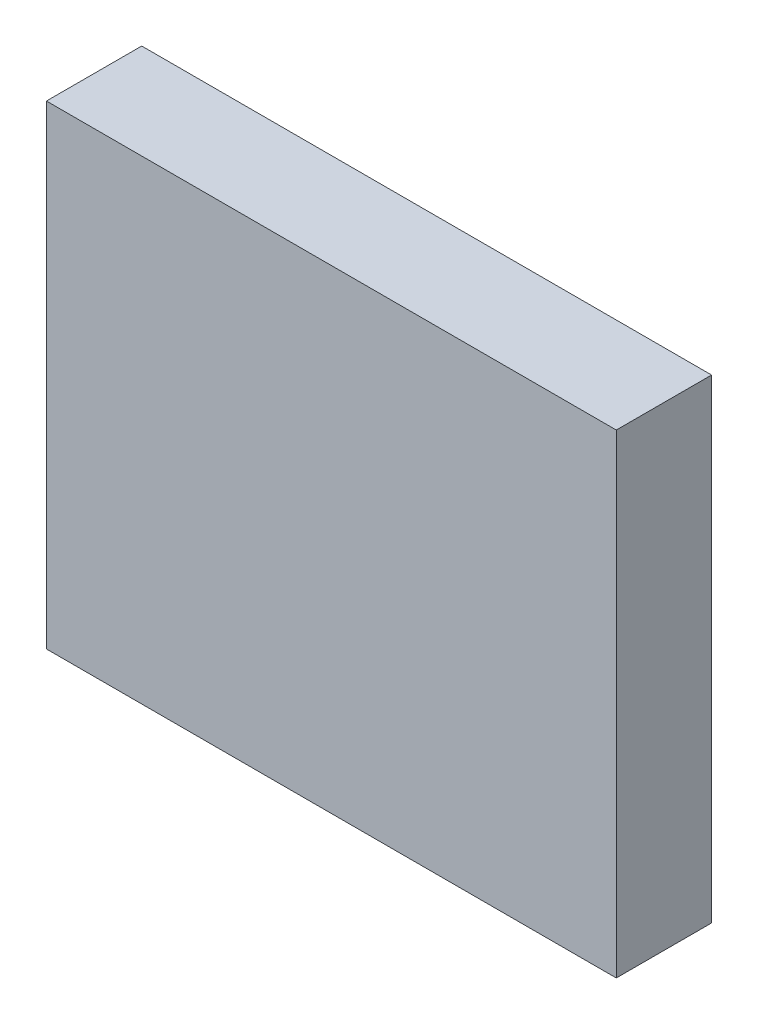
ISO-10303-21;
HEADER;
FILE_DESCRIPTION(('STEP AP214'),'2;1');
FILE_NAME('part.step','',(''),(''),'','','');
FILE_SCHEMA(('AUTOMOTIVE_DESIGN { 1 0 10303 214 1 1 1 1 }'));
ENDSEC;
DATA;
#1=APPLICATION_CONTEXT('core data for automotive mechanical design processes');
#2=APPLICATION_PROTOCOL_DEFINITION('international standard','automotive_design',2000,#1);
#3=PRODUCT_CONTEXT('',#1,'mechanical');
#4=PRODUCT('Part','Part','',(#3));
#5=PRODUCT_RELATED_PRODUCT_CATEGORY('part','',(#4));
#6=PRODUCT_DEFINITION_FORMATION('','',#4);
#7=PRODUCT_DEFINITION_CONTEXT('part definition',#1,'design');
#8=PRODUCT_DEFINITION('design','',#6,#7);
#9=PRODUCT_DEFINITION_SHAPE('','',#8);
#10=(LENGTH_UNIT() NAMED_UNIT(*) SI_UNIT(.MILLI.,.METRE.));
#11=(NAMED_UNIT(*) PLANE_ANGLE_UNIT() SI_UNIT($,.RADIAN.));
#12=(NAMED_UNIT(*) SI_UNIT($,.STERADIAN.) SOLID_ANGLE_UNIT());
#13=UNCERTAINTY_MEASURE_WITH_UNIT(LENGTH_MEASURE(1.E-05),#10,'distance_accuracy_value','');
#14=(GEOMETRIC_REPRESENTATION_CONTEXT(3) GLOBAL_UNCERTAINTY_ASSIGNED_CONTEXT((#13)) GLOBAL_UNIT_ASSIGNED_CONTEXT((#10,
#11,#12)) REPRESENTATION_CONTEXT('',''));
#15=CARTESIAN_POINT('',(0.,0.,0.));
#16=DIRECTION('',(0.,0.,1.));
#17=DIRECTION('',(1.,0.,0.));
#18=AXIS2_PLACEMENT_3D('',#15,#16,#17);
#19=CARTESIAN_POINT('',(0.698,0.373,0.));
#20=DIRECTION('',(0.,-1.,0.));
#21=DIRECTION('',(0.,0.,1.));
#22=AXIS2_PLACEMENT_3D('',#19,#20,#21);
#23=PLANE('',#22);
#24=DIRECTION('',(-1.,0.,0.));
#25=VECTOR('',#24,1.);
#26=CARTESIAN_POINT('',(1.003,0.373,0.));
#27=LINE('',#26,#25);
#28=CARTESIAN_POINT('',(1.003,0.373,0.));
#29=VERTEX_POINT('',#28);
#30=CARTESIAN_POINT('',(0.698,0.373,0.));
#31=VERTEX_POINT('',#30);
#32=EDGE_CURVE('E11',#29,#31,#27,.T.);
#33=ORIENTED_EDGE('',*,*,#32,.F.);
#34=DIRECTION('',(0.,0.,-1.));
#35=VECTOR('',#34,1.);
#36=CARTESIAN_POINT('',(1.003,0.373,0.051));
#37=LINE('',#36,#35);
#38=CARTESIAN_POINT('',(1.003,0.373,0.051));
#39=VERTEX_POINT('',#38);
#40=EDGE_CURVE('E24',#39,#29,#37,.T.);
#41=ORIENTED_EDGE('',*,*,#40,.F.);
#42=DIRECTION('',(1.,0.,0.));
#43=VECTOR('',#42,1.);
#44=CARTESIAN_POINT('',(0.698,0.373,0.051));
#45=LINE('',#44,#43);
#46=CARTESIAN_POINT('',(0.698,0.373,0.051));
#47=VERTEX_POINT('',#46);
#48=EDGE_CURVE('E88',#47,#39,#45,.T.);
#49=ORIENTED_EDGE('',*,*,#48,.F.);
#50=DIRECTION('',(0.,0.,1.));
#51=VECTOR('',#50,1.);
#52=CARTESIAN_POINT('',(0.698,0.373,0.));
#53=LINE('',#52,#51);
#54=EDGE_CURVE('E77',#31,#47,#53,.T.);
#55=ORIENTED_EDGE('',*,*,#54,.F.);
#56=EDGE_LOOP('',(#33,#41,#49,#55));
#57=FACE_BOUND('',#56,.T.);
#58=ADVANCED_FACE('F17',(#57),#23,.T.);
#59=CARTESIAN_POINT('',(1.003,0.373,0.));
#60=DIRECTION('',(1.,0.,0.));
#61=DIRECTION('',(0.,0.,1.));
#62=AXIS2_PLACEMENT_3D('',#59,#60,#61);
#63=PLANE('',#62);
#64=DIRECTION('',(0.,-1.,0.));
#65=VECTOR('',#64,1.);
#66=CARTESIAN_POINT('',(1.003,0.627,0.));
#67=LINE('',#66,#65);
#68=CARTESIAN_POINT('',(1.003,0.627,0.));
#69=VERTEX_POINT('',#68);
#70=EDGE_CURVE('E85',#69,#29,#67,.T.);
#71=ORIENTED_EDGE('',*,*,#70,.F.);
#72=DIRECTION('',(0.,0.,-1.));
#73=VECTOR('',#72,1.);
#74=CARTESIAN_POINT('',(1.003,0.627,0.051));
#75=LINE('',#74,#73);
#76=CARTESIAN_POINT('',(1.003,0.627,0.051));
#77=VERTEX_POINT('',#76);
#78=EDGE_CURVE('E83',#77,#69,#75,.T.);
#79=ORIENTED_EDGE('',*,*,#78,.F.);
#80=DIRECTION('',(0.,1.,0.));
#81=VECTOR('',#80,1.);
#82=CARTESIAN_POINT('',(1.003,0.373,0.051));
#83=LINE('',#82,#81);
#84=EDGE_CURVE('E72',#39,#77,#83,.T.);
#85=ORIENTED_EDGE('',*,*,#84,.F.);
#86=ORIENTED_EDGE('',*,*,#40,.T.);
#87=EDGE_LOOP('',(#71,#79,#85,#86));
#88=FACE_BOUND('',#87,.T.);
#89=ADVANCED_FACE('F90',(#88),#63,.T.);
#90=CARTESIAN_POINT('',(1.003,0.627,0.));
#91=DIRECTION('',(0.,1.,0.));
#92=DIRECTION('',(0.,0.,1.));
#93=AXIS2_PLACEMENT_3D('',#90,#91,#92);
#94=PLANE('',#93);
#95=DIRECTION('',(1.,0.,0.));
#96=VECTOR('',#95,1.);
#97=CARTESIAN_POINT('',(0.698,0.627,0.));
#98=LINE('',#97,#96);
#99=CARTESIAN_POINT('',(0.698,0.627,0.));
#100=VERTEX_POINT('',#99);
#101=EDGE_CURVE('E60',#100,#69,#98,.T.);
#102=ORIENTED_EDGE('',*,*,#101,.F.);
#103=DIRECTION('',(0.,0.,-1.));
#104=VECTOR('',#103,1.);
#105=CARTESIAN_POINT('',(0.698,0.627,0.051));
#106=LINE('',#105,#104);
#107=CARTESIAN_POINT('',(0.698,0.627,0.051));
#108=VERTEX_POINT('',#107);
#109=EDGE_CURVE('E54',#108,#100,#106,.T.);
#110=ORIENTED_EDGE('',*,*,#109,.F.);
#111=DIRECTION('',(-1.,0.,0.));
#112=VECTOR('',#111,1.);
#113=CARTESIAN_POINT('',(1.003,0.627,0.051));
#114=LINE('',#113,#112);
#115=EDGE_CURVE('E58',#77,#108,#114,.T.);
#116=ORIENTED_EDGE('',*,*,#115,.F.);
#117=ORIENTED_EDGE('',*,*,#78,.T.);
#118=EDGE_LOOP('',(#102,#110,#116,#117));
#119=FACE_BOUND('',#118,.T.);
#120=ADVANCED_FACE('F56',(#119),#94,.T.);
#121=CARTESIAN_POINT('',(0.698,0.627,0.));
#122=DIRECTION('',(-1.,0.,0.));
#123=DIRECTION('',(0.,0.,1.));
#124=AXIS2_PLACEMENT_3D('',#121,#122,#123);
#125=PLANE('',#124);
#126=DIRECTION('',(0.,1.,0.));
#127=VECTOR('',#126,1.);
#128=CARTESIAN_POINT('',(0.698,0.373,0.));
#129=LINE('',#128,#127);
#130=EDGE_CURVE('E73',#31,#100,#129,.T.);
#131=ORIENTED_EDGE('',*,*,#130,.F.);
#132=ORIENTED_EDGE('',*,*,#54,.T.);
#133=DIRECTION('',(0.,-1.,0.));
#134=VECTOR('',#133,1.);
#135=CARTESIAN_POINT('',(0.698,0.627,0.051));
#136=LINE('',#135,#134);
#137=EDGE_CURVE('E70',#108,#47,#136,.T.);
#138=ORIENTED_EDGE('',*,*,#137,.F.);
#139=ORIENTED_EDGE('',*,*,#109,.T.);
#140=EDGE_LOOP('',(#131,#132,#138,#139));
#141=FACE_BOUND('',#140,.T.);
#142=ADVANCED_FACE('F76',(#141),#125,.T.);
#143=CARTESIAN_POINT('',(0.698,0.627,0.));
#144=DIRECTION('',(0.,0.,-1.));
#145=DIRECTION('',(0.,1.,0.));
#146=AXIS2_PLACEMENT_3D('',#143,#144,#145);
#147=PLANE('',#146);
#148=ORIENTED_EDGE('',*,*,#101,.T.);
#149=ORIENTED_EDGE('',*,*,#70,.T.);
#150=ORIENTED_EDGE('',*,*,#32,.T.);
#151=ORIENTED_EDGE('',*,*,#130,.T.);
#152=EDGE_LOOP('',(#148,#149,#150,#151));
#153=FACE_BOUND('',#152,.T.);
#154=ADVANCED_FACE('F91',(#153),#147,.T.);
#155=CARTESIAN_POINT('',(0.698,0.373,0.051));
#156=DIRECTION('',(0.,0.,1.));
#157=DIRECTION('',(0.,1.,0.));
#158=AXIS2_PLACEMENT_3D('',#155,#156,#157);
#159=PLANE('',#158);
#160=ORIENTED_EDGE('',*,*,#48,.T.);
#161=ORIENTED_EDGE('',*,*,#84,.T.);
#162=ORIENTED_EDGE('',*,*,#115,.T.);
#163=ORIENTED_EDGE('',*,*,#137,.T.);
#164=EDGE_LOOP('',(#160,#161,#162,#163));
#165=FACE_BOUND('',#164,.T.);
#166=ADVANCED_FACE('F69',(#165),#159,.T.);
#167=CLOSED_SHELL('',(#58,#89,#120,#142,#154,#166));
#168=MANIFOLD_SOLID_BREP('B1',#167);
#169=ADVANCED_BREP_SHAPE_REPRESENTATION('',(#18,#168),#14);
#170=SHAPE_DEFINITION_REPRESENTATION(#9,#169);
ENDSEC;
END-ISO-10303-21;
